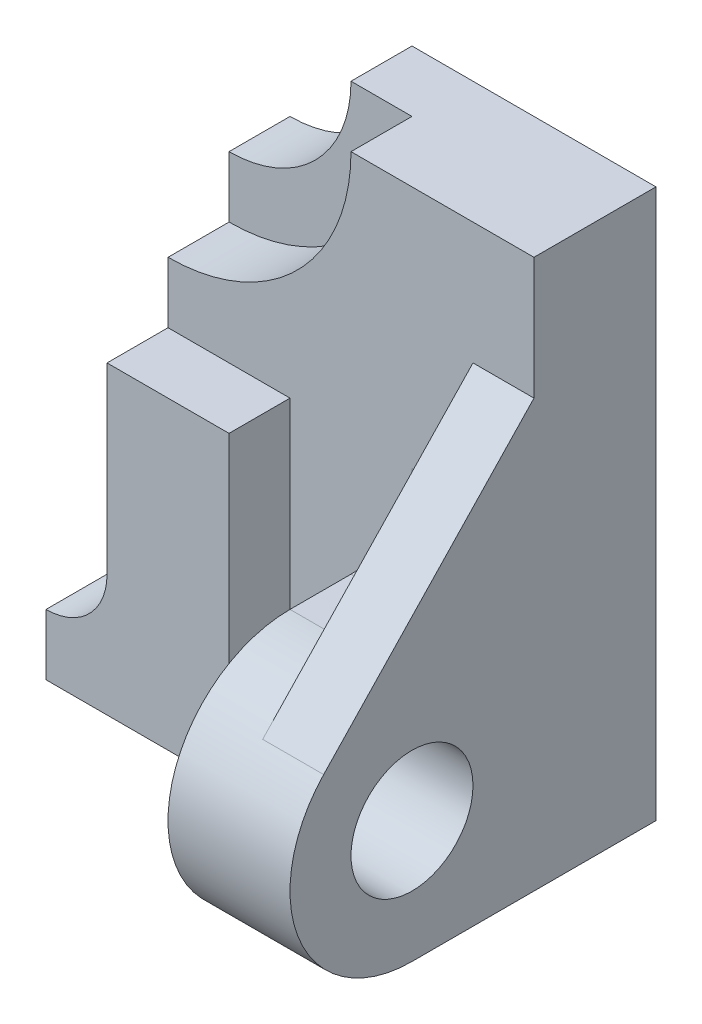
ISO-10303-21;
HEADER;
FILE_DESCRIPTION(('STEP AP214'),'2;1');
FILE_NAME('part.step','',(''),(''),'','','');
FILE_SCHEMA(('AUTOMOTIVE_DESIGN { 1 0 10303 214 1 1 1 1 }'));
ENDSEC;
DATA;
#1=APPLICATION_CONTEXT('core data for automotive mechanical design processes');
#2=APPLICATION_PROTOCOL_DEFINITION('international standard','automotive_design',2000,#1);
#3=PRODUCT_CONTEXT('',#1,'mechanical');
#4=PRODUCT('Part','Part','',(#3));
#5=PRODUCT_RELATED_PRODUCT_CATEGORY('part','',(#4));
#6=PRODUCT_DEFINITION_FORMATION('','',#4);
#7=PRODUCT_DEFINITION_CONTEXT('part definition',#1,'design');
#8=PRODUCT_DEFINITION('design','',#6,#7);
#9=PRODUCT_DEFINITION_SHAPE('','',#8);
#10=(LENGTH_UNIT() NAMED_UNIT(*) SI_UNIT(.MILLI.,.METRE.));
#11=(NAMED_UNIT(*) PLANE_ANGLE_UNIT() SI_UNIT($,.RADIAN.));
#12=(NAMED_UNIT(*) SI_UNIT($,.STERADIAN.) SOLID_ANGLE_UNIT());
#13=UNCERTAINTY_MEASURE_WITH_UNIT(LENGTH_MEASURE(1.E-05),#10,'distance_accuracy_value','');
#14=(GEOMETRIC_REPRESENTATION_CONTEXT(3) GLOBAL_UNCERTAINTY_ASSIGNED_CONTEXT((#13)) GLOBAL_UNIT_ASSIGNED_CONTEXT((#10,
#11,#12)) REPRESENTATION_CONTEXT('',''));
#15=CARTESIAN_POINT('',(0.,0.,0.));
#16=DIRECTION('',(0.,0.,1.));
#17=DIRECTION('',(1.,0.,0.));
#18=AXIS2_PLACEMENT_3D('',#15,#16,#17);
#19=CARTESIAN_POINT('',(1.,-2.5,4.));
#20=DIRECTION('',(1.,0.,0.));
#21=DIRECTION('',(0.,0.,-1.));
#22=AXIS2_PLACEMENT_3D('',#19,#20,#21);
#23=CYLINDRICAL_SURFACE('',#22,2.);
#24=DIRECTION('',(1.,0.,0.));
#25=VECTOR('',#24,1.);
#26=CARTESIAN_POINT('',(2.,-1.12068965517241,5.44827586206897));
#27=LINE('',#26,#25);
#28=CARTESIAN_POINT('',(2.,-1.12068965517241,5.44827586206897));
#29=VERTEX_POINT('',#28);
#30=CARTESIAN_POINT('',(3.,-1.12068965517241,5.44827586206897));
#31=VERTEX_POINT('',#30);
#32=EDGE_CURVE('E200',#29,#31,#27,.T.);
#33=ORIENTED_EDGE('',*,*,#32,.F.);
#34=CARTESIAN_POINT('',(2.,-2.5,4.));
#35=DIRECTION('',(-1.,0.,0.));
#36=DIRECTION('',(0.,0.,1.));
#37=AXIS2_PLACEMENT_3D('',#34,#35,#36);
#38=CIRCLE('',#37,2.);
#39=CARTESIAN_POINT('',(2.,-0.499999999999998,4.));
#40=VERTEX_POINT('',#39);
#41=EDGE_CURVE('E336',#29,#40,#38,.T.);
#42=ORIENTED_EDGE('',*,*,#41,.T.);
#43=DIRECTION('',(1.,0.,0.));
#44=VECTOR('',#43,1.);
#45=CARTESIAN_POINT('',(1.,-0.499999999999998,4.));
#46=LINE('',#45,#44);
#47=CARTESIAN_POINT('',(1.,-0.499999999999998,4.));
#48=VERTEX_POINT('',#47);
#49=EDGE_CURVE('E181',#48,#40,#46,.T.);
#50=ORIENTED_EDGE('',*,*,#49,.F.);
#51=CARTESIAN_POINT('',(1.,-2.5,4.));
#52=DIRECTION('',(1.,0.,0.));
#53=DIRECTION('',(0.,0.,-1.));
#54=AXIS2_PLACEMENT_3D('',#51,#52,#53);
#55=CIRCLE('',#54,2.);
#56=CARTESIAN_POINT('',(1.,-4.5,4.));
#57=VERTEX_POINT('',#56);
#58=EDGE_CURVE('E169',#57,#48,#55,.F.);
#59=ORIENTED_EDGE('',*,*,#58,.F.);
#60=DIRECTION('',(1.,0.,0.));
#61=VECTOR('',#60,1.);
#62=CARTESIAN_POINT('',(1.,-4.5,4.));
#63=LINE('',#62,#61);
#64=CARTESIAN_POINT('',(3.,-4.5,4.));
#65=VERTEX_POINT('',#64);
#66=EDGE_CURVE('E204',#57,#65,#63,.T.);
#67=ORIENTED_EDGE('',*,*,#66,.T.);
#68=CARTESIAN_POINT('',(3.,-2.5,4.));
#69=DIRECTION('',(1.,0.,0.));
#70=DIRECTION('',(0.,0.,-1.));
#71=AXIS2_PLACEMENT_3D('',#68,#69,#70);
#72=CIRCLE('',#71,2.);
#73=EDGE_CURVE('E189',#65,#31,#72,.F.);
#74=ORIENTED_EDGE('',*,*,#73,.T.);
#75=EDGE_LOOP('',(#33,#42,#50,#59,#67,#74));
#76=FACE_BOUND('',#75,.T.);
#77=ADVANCED_FACE('F35',(#76),#23,.T.);
#78=CARTESIAN_POINT('',(0.,0.,2.));
#79=DIRECTION('',(0.,0.,1.));
#80=DIRECTION('',(1.,0.,0.));
#81=AXIS2_PLACEMENT_3D('',#78,#79,#80);
#82=PLANE('',#81);
#83=DIRECTION('',(1.,0.,0.));
#84=VECTOR('',#83,1.);
#85=CARTESIAN_POINT('',(2.,2.5,2.));
#86=LINE('',#85,#84);
#87=CARTESIAN_POINT('',(2.,2.5,2.));
#88=VERTEX_POINT('',#87);
#89=CARTESIAN_POINT('',(3.,2.5,2.));
#90=VERTEX_POINT('',#89);
#91=EDGE_CURVE('E56',#88,#90,#86,.T.);
#92=ORIENTED_EDGE('',*,*,#91,.T.);
#93=DIRECTION('',(0.,1.,0.));
#94=VECTOR('',#93,1.);
#95=CARTESIAN_POINT('',(3.,-4.5,2.));
#96=LINE('',#95,#94);
#97=CARTESIAN_POINT('',(3.,4.5,2.));
#98=VERTEX_POINT('',#97);
#99=EDGE_CURVE('E273',#90,#98,#96,.T.);
#100=ORIENTED_EDGE('',*,*,#99,.T.);
#101=DIRECTION('',(-1.,0.,0.));
#102=VECTOR('',#101,1.);
#103=CARTESIAN_POINT('',(3.,4.5,2.));
#104=LINE('',#103,#102);
#105=CARTESIAN_POINT('',(0.,4.5,2.));
#106=VERTEX_POINT('',#105);
#107=EDGE_CURVE('E281',#98,#106,#104,.T.);
#108=ORIENTED_EDGE('',*,*,#107,.T.);
#109=CARTESIAN_POINT('',(-3.,4.5,2.));
#110=DIRECTION('',(0.,0.,1.));
#111=DIRECTION('',(-1.,0.,0.));
#112=AXIS2_PLACEMENT_3D('',#109,#110,#111);
#113=CIRCLE('',#112,3.);
#114=CARTESIAN_POINT('',(-3.,1.5,2.));
#115=VERTEX_POINT('',#114);
#116=EDGE_CURVE('E260',#115,#106,#113,.T.);
#117=ORIENTED_EDGE('',*,*,#116,.F.);
#118=DIRECTION('',(0.,-1.,0.));
#119=VECTOR('',#118,1.);
#120=CARTESIAN_POINT('',(-3.,-4.5,2.));
#121=LINE('',#120,#119);
#122=CARTESIAN_POINT('',(-3.,0.500000000000001,2.));
#123=VERTEX_POINT('',#122);
#124=EDGE_CURVE('E274',#115,#123,#121,.T.);
#125=ORIENTED_EDGE('',*,*,#124,.T.);
#126=DIRECTION('',(-1.,0.,0.));
#127=VECTOR('',#126,1.);
#128=CARTESIAN_POINT('',(-3.,0.500000000000001,2.));
#129=LINE('',#128,#127);
#130=CARTESIAN_POINT('',(-0.999999999999999,0.500000000000001,2.));
#131=VERTEX_POINT('',#130);
#132=EDGE_CURVE('E232',#131,#123,#129,.T.);
#133=ORIENTED_EDGE('',*,*,#132,.F.);
#134=DIRECTION('',(0.,1.,0.));
#135=VECTOR('',#134,1.);
#136=CARTESIAN_POINT('',(-0.999999999999999,0.500000000000001,2.));
#137=LINE('',#136,#135);
#138=CARTESIAN_POINT('',(-0.999999999999999,-4.5,2.));
#139=VERTEX_POINT('',#138);
#140=EDGE_CURVE('E223',#139,#131,#137,.T.);
#141=ORIENTED_EDGE('',*,*,#140,.F.);
#142=DIRECTION('',(1.,0.,0.));
#143=VECTOR('',#142,1.);
#144=CARTESIAN_POINT('',(3.,-4.5,2.));
#145=LINE('',#144,#143);
#146=CARTESIAN_POINT('',(1.,-4.5,2.));
#147=VERTEX_POINT('',#146);
#148=EDGE_CURVE('E270',#139,#147,#145,.T.);
#149=ORIENTED_EDGE('',*,*,#148,.T.);
#150=DIRECTION('',(0.,-1.,0.));
#151=VECTOR('',#150,1.);
#152=CARTESIAN_POINT('',(1.,0.,2.));
#153=LINE('',#152,#151);
#154=CARTESIAN_POINT('',(1.,0.500000000000001,2.));
#155=VERTEX_POINT('',#154);
#156=EDGE_CURVE('E182',#155,#147,#153,.T.);
#157=ORIENTED_EDGE('',*,*,#156,.F.);
#158=DIRECTION('',(1.,0.,0.));
#159=VECTOR('',#158,1.);
#160=CARTESIAN_POINT('',(1.,0.500000000000001,2.));
#161=LINE('',#160,#159);
#162=CARTESIAN_POINT('',(2.,0.500000000000001,2.));
#163=VERTEX_POINT('',#162);
#164=EDGE_CURVE('E185',#155,#163,#161,.T.);
#165=ORIENTED_EDGE('',*,*,#164,.T.);
#166=DIRECTION('',(0.,1.,0.));
#167=VECTOR('',#166,1.);
#168=CARTESIAN_POINT('',(2.,2.5,2.));
#169=LINE('',#168,#167);
#170=EDGE_CURVE('E52',#163,#88,#169,.T.);
#171=ORIENTED_EDGE('',*,*,#170,.T.);
#172=EDGE_LOOP('',(#92,#100,#108,#117,#125,#133,#141,#149,#157,#165,#171));
#173=FACE_BOUND('',#172,.T.);
#174=ADVANCED_FACE('F346',(#173),#82,.T.);
#175=CARTESIAN_POINT('',(-3.,-4.5,2.));
#176=DIRECTION('',(1.,0.,0.));
#177=DIRECTION('',(0.,0.,-1.));
#178=AXIS2_PLACEMENT_3D('',#175,#176,#177);
#179=PLANE('',#178);
#180=DIRECTION('',(0.,0.,1.));
#181=VECTOR('',#180,1.);
#182=CARTESIAN_POINT('',(-3.,-2.5,0.));
#183=LINE('',#182,#181);
#184=CARTESIAN_POINT('',(-3.,-2.5,0.));
#185=VERTEX_POINT('',#184);
#186=CARTESIAN_POINT('',(-3.,-2.5,3.));
#187=VERTEX_POINT('',#186);
#188=EDGE_CURVE('E215',#185,#187,#183,.T.);
#189=ORIENTED_EDGE('',*,*,#188,.T.);
#190=DIRECTION('',(0.,-1.,0.));
#191=VECTOR('',#190,1.);
#192=CARTESIAN_POINT('',(-3.,-4.5,3.));
#193=LINE('',#192,#191);
#194=CARTESIAN_POINT('',(-3.,0.500000000000001,3.));
#195=VERTEX_POINT('',#194);
#196=EDGE_CURVE('E236',#195,#187,#193,.T.);
#197=ORIENTED_EDGE('',*,*,#196,.F.);
#198=DIRECTION('',(0.,0.,-1.));
#199=VECTOR('',#198,1.);
#200=CARTESIAN_POINT('',(-3.,0.500000000000001,3.));
#201=LINE('',#200,#199);
#202=EDGE_CURVE('E239',#195,#123,#201,.T.);
#203=ORIENTED_EDGE('',*,*,#202,.T.);
#204=ORIENTED_EDGE('',*,*,#124,.F.);
#205=DIRECTION('',(0.,0.,1.));
#206=VECTOR('',#205,1.);
#207=CARTESIAN_POINT('',(-3.,1.5,1.));
#208=LINE('',#207,#206);
#209=CARTESIAN_POINT('',(-3.,1.5,1.));
#210=VERTEX_POINT('',#209);
#211=EDGE_CURVE('E367',#210,#115,#208,.T.);
#212=ORIENTED_EDGE('',*,*,#211,.F.);
#213=DIRECTION('',(0.,-1.,0.));
#214=VECTOR('',#213,1.);
#215=CARTESIAN_POINT('',(-3.,4.5,1.));
#216=LINE('',#215,#214);
#217=CARTESIAN_POINT('',(-3.,2.5,1.));
#218=VERTEX_POINT('',#217);
#219=EDGE_CURVE('E264',#218,#210,#216,.T.);
#220=ORIENTED_EDGE('',*,*,#219,.F.);
#221=DIRECTION('',(0.,0.,1.));
#222=VECTOR('',#221,1.);
#223=CARTESIAN_POINT('',(-3.,2.5,0.));
#224=LINE('',#223,#222);
#225=CARTESIAN_POINT('',(-3.,2.5,0.));
#226=VERTEX_POINT('',#225);
#227=EDGE_CURVE('E360',#226,#218,#224,.T.);
#228=ORIENTED_EDGE('',*,*,#227,.F.);
#229=DIRECTION('',(0.,-1.,0.));
#230=VECTOR('',#229,1.);
#231=CARTESIAN_POINT('',(-3.,-4.5,0.));
#232=LINE('',#231,#230);
#233=EDGE_CURVE('E285',#226,#185,#232,.T.);
#234=ORIENTED_EDGE('',*,*,#233,.T.);
#235=EDGE_LOOP('',(#189,#197,#203,#204,#212,#220,#228,#234));
#236=FACE_BOUND('',#235,.T.);
#237=ADVANCED_FACE('F37',(#236),#179,.F.);
#238=CARTESIAN_POINT('',(3.,-4.5,2.));
#239=DIRECTION('',(0.,1.,0.));
#240=DIRECTION('',(-1.,0.,0.));
#241=AXIS2_PLACEMENT_3D('',#238,#239,#240);
#242=PLANE('',#241);
#243=DIRECTION('',(1.,0.,0.));
#244=VECTOR('',#243,1.);
#245=CARTESIAN_POINT('',(3.,-4.5,0.));
#246=LINE('',#245,#244);
#247=CARTESIAN_POINT('',(-4.,-4.5,0.));
#248=VERTEX_POINT('',#247);
#249=CARTESIAN_POINT('',(3.,-4.5,0.));
#250=VERTEX_POINT('',#249);
#251=EDGE_CURVE('E288',#248,#250,#246,.T.);
#252=ORIENTED_EDGE('',*,*,#251,.T.);
#253=DIRECTION('',(0.,0.,-1.));
#254=VECTOR('',#253,1.);
#255=CARTESIAN_POINT('',(3.,-4.5,2.));
#256=LINE('',#255,#254);
#257=EDGE_CURVE('E44',#65,#250,#256,.T.);
#258=ORIENTED_EDGE('',*,*,#257,.F.);
#259=ORIENTED_EDGE('',*,*,#66,.F.);
#260=DIRECTION('',(0.,0.,1.));
#261=VECTOR('',#260,1.);
#262=CARTESIAN_POINT('',(1.,-4.5,0.));
#263=LINE('',#262,#261);
#264=EDGE_CURVE('E194',#147,#57,#263,.T.);
#265=ORIENTED_EDGE('',*,*,#264,.F.);
#266=ORIENTED_EDGE('',*,*,#148,.F.);
#267=DIRECTION('',(0.,0.,-1.));
#268=VECTOR('',#267,1.);
#269=CARTESIAN_POINT('',(-0.999999999999998,-4.5,3.));
#270=LINE('',#269,#268);
#271=CARTESIAN_POINT('',(-0.999999999999998,-4.5,3.));
#272=VERTEX_POINT('',#271);
#273=EDGE_CURVE('E255',#272,#139,#270,.T.);
#274=ORIENTED_EDGE('',*,*,#273,.F.);
#275=DIRECTION('',(1.,0.,0.));
#276=VECTOR('',#275,1.);
#277=CARTESIAN_POINT('',(-0.999999999999998,-4.5,3.));
#278=LINE('',#277,#276);
#279=CARTESIAN_POINT('',(-4.,-4.5,3.));
#280=VERTEX_POINT('',#279);
#281=EDGE_CURVE('E228',#280,#272,#278,.T.);
#282=ORIENTED_EDGE('',*,*,#281,.F.);
#283=DIRECTION('',(0.,0.,1.));
#284=VECTOR('',#283,1.);
#285=CARTESIAN_POINT('',(-4.,-4.5,0.));
#286=LINE('',#285,#284);
#287=EDGE_CURVE('E220',#248,#280,#286,.T.);
#288=ORIENTED_EDGE('',*,*,#287,.F.);
#289=EDGE_LOOP('',(#252,#258,#259,#265,#266,#274,#282,#288));
#290=FACE_BOUND('',#289,.T.);
#291=ADVANCED_FACE('F344',(#290),#242,.F.);
#292=CARTESIAN_POINT('',(3.,-4.5,2.));
#293=DIRECTION('',(-1.,0.,0.));
#294=DIRECTION('',(0.,0.,1.));
#295=AXIS2_PLACEMENT_3D('',#292,#293,#294);
#296=PLANE('',#295);
#297=ORIENTED_EDGE('',*,*,#99,.F.);
#298=DIRECTION('',(0.,-0.724137931034483,0.689655172413793));
#299=VECTOR('',#298,1.);
#300=CARTESIAN_POINT('',(3.,2.5,2.));
#301=LINE('',#300,#299);
#302=EDGE_CURVE('E323',#90,#31,#301,.T.);
#303=ORIENTED_EDGE('',*,*,#302,.T.);
#304=ORIENTED_EDGE('',*,*,#73,.F.);
#305=ORIENTED_EDGE('',*,*,#257,.T.);
#306=DIRECTION('',(0.,1.,0.));
#307=VECTOR('',#306,1.);
#308=CARTESIAN_POINT('',(3.,-4.5,0.));
#309=LINE('',#308,#307);
#310=CARTESIAN_POINT('',(3.,4.5,0.));
#311=VERTEX_POINT('',#310);
#312=EDGE_CURVE('E291',#250,#311,#309,.T.);
#313=ORIENTED_EDGE('',*,*,#312,.T.);
#314=DIRECTION('',(0.,0.,-1.));
#315=VECTOR('',#314,1.);
#316=CARTESIAN_POINT('',(3.,4.5,2.));
#317=LINE('',#316,#315);
#318=EDGE_CURVE('E284',#98,#311,#317,.T.);
#319=ORIENTED_EDGE('',*,*,#318,.F.);
#320=EDGE_LOOP('',(#297,#303,#304,#305,#313,#319));
#321=FACE_BOUND('',#320,.T.);
#322=CARTESIAN_POINT('',(3.,-2.5,4.));
#323=DIRECTION('',(1.,0.,0.));
#324=DIRECTION('',(0.,0.,-1.));
#325=AXIS2_PLACEMENT_3D('',#322,#323,#324);
#326=CIRCLE('',#325,1.);
#327=CARTESIAN_POINT('',(3.,-2.5,3.));
#328=VERTEX_POINT('',#327);
#329=EDGE_CURVE('E197',#328,#328,#326,.T.);
#330=ORIENTED_EDGE('',*,*,#329,.F.);
#331=EDGE_LOOP('',(#330));
#332=FACE_BOUND('',#331,.T.);
#333=ADVANCED_FACE('F302',(#321,#332),#296,.F.);
#334=CARTESIAN_POINT('',(3.,4.5,2.));
#335=DIRECTION('',(0.,-1.,0.));
#336=DIRECTION('',(1.,0.,0.));
#337=AXIS2_PLACEMENT_3D('',#334,#335,#336);
#338=PLANE('',#337);
#339=DIRECTION('',(-1.,0.,0.));
#340=VECTOR('',#339,1.);
#341=CARTESIAN_POINT('',(0.,4.5,1.));
#342=LINE('',#341,#340);
#343=CARTESIAN_POINT('',(0.,4.5,1.));
#344=VERTEX_POINT('',#343);
#345=CARTESIAN_POINT('',(-0.999999999999999,4.5,1.));
#346=VERTEX_POINT('',#345);
#347=EDGE_CURVE('E369',#344,#346,#342,.T.);
#348=ORIENTED_EDGE('',*,*,#347,.F.);
#349=DIRECTION('',(0.,0.,1.));
#350=VECTOR('',#349,1.);
#351=CARTESIAN_POINT('',(0.,4.5,1.));
#352=LINE('',#351,#350);
#353=EDGE_CURVE('E364',#344,#106,#352,.T.);
#354=ORIENTED_EDGE('',*,*,#353,.T.);
#355=ORIENTED_EDGE('',*,*,#107,.F.);
#356=ORIENTED_EDGE('',*,*,#318,.T.);
#357=DIRECTION('',(-1.,0.,0.));
#358=VECTOR('',#357,1.);
#359=CARTESIAN_POINT('',(3.,4.5,0.));
#360=LINE('',#359,#358);
#361=CARTESIAN_POINT('',(-0.999999999999999,4.5,0.));
#362=VERTEX_POINT('',#361);
#363=EDGE_CURVE('E293',#311,#362,#360,.T.);
#364=ORIENTED_EDGE('',*,*,#363,.T.);
#365=DIRECTION('',(0.,0.,1.));
#366=VECTOR('',#365,1.);
#367=CARTESIAN_POINT('',(-0.999999999999999,4.5,0.));
#368=LINE('',#367,#366);
#369=EDGE_CURVE('E289',#362,#346,#368,.T.);
#370=ORIENTED_EDGE('',*,*,#369,.T.);
#371=EDGE_LOOP('',(#348,#354,#355,#356,#364,#370));
#372=FACE_BOUND('',#371,.T.);
#373=ADVANCED_FACE('F319',(#372),#338,.F.);
#374=CARTESIAN_POINT('',(0.,0.,0.));
#375=DIRECTION('',(0.,0.,1.));
#376=DIRECTION('',(1.,0.,0.));
#377=AXIS2_PLACEMENT_3D('',#374,#375,#376);
#378=PLANE('',#377);
#379=ORIENTED_EDGE('',*,*,#233,.F.);
#380=CARTESIAN_POINT('',(-3.,4.5,0.));
#381=DIRECTION('',(0.,0.,1.));
#382=DIRECTION('',(-1.,0.,0.));
#383=AXIS2_PLACEMENT_3D('',#380,#381,#382);
#384=CIRCLE('',#383,2.);
#385=EDGE_CURVE('E315',#226,#362,#384,.T.);
#386=ORIENTED_EDGE('',*,*,#385,.T.);
#387=ORIENTED_EDGE('',*,*,#363,.F.);
#388=ORIENTED_EDGE('',*,*,#312,.F.);
#389=ORIENTED_EDGE('',*,*,#251,.F.);
#390=DIRECTION('',(0.,-1.,0.));
#391=VECTOR('',#390,1.);
#392=CARTESIAN_POINT('',(-4.,-4.5,0.));
#393=LINE('',#392,#391);
#394=CARTESIAN_POINT('',(-4.,-3.5,0.));
#395=VERTEX_POINT('',#394);
#396=EDGE_CURVE('E211',#395,#248,#393,.T.);
#397=ORIENTED_EDGE('',*,*,#396,.F.);
#398=CARTESIAN_POINT('',(-4.,-2.5,0.));
#399=DIRECTION('',(0.,0.,-1.));
#400=DIRECTION('',(1.,0.,0.));
#401=AXIS2_PLACEMENT_3D('',#398,#399,#400);
#402=CIRCLE('',#401,1.);
#403=EDGE_CURVE('E208',#185,#395,#402,.T.);
#404=ORIENTED_EDGE('',*,*,#403,.F.);
#405=EDGE_LOOP('',(#379,#386,#387,#388,#389,#397,#404));
#406=FACE_BOUND('',#405,.T.);
#407=ADVANCED_FACE('F311',(#406),#378,.F.);
#408=CARTESIAN_POINT('',(-3.,4.5,0.));
#409=DIRECTION('',(0.,0.,1.));
#410=DIRECTION('',(1.,0.,0.));
#411=AXIS2_PLACEMENT_3D('',#408,#409,#410);
#412=CYLINDRICAL_SURFACE('',#411,2.);
#413=ORIENTED_EDGE('',*,*,#227,.T.);
#414=CARTESIAN_POINT('',(-3.,4.5,1.));
#415=DIRECTION('',(0.,0.,-1.));
#416=DIRECTION('',(-1.,0.,0.));
#417=AXIS2_PLACEMENT_3D('',#414,#415,#416);
#418=CIRCLE('',#417,2.);
#419=EDGE_CURVE('E11',#218,#346,#418,.F.);
#420=ORIENTED_EDGE('',*,*,#419,.T.);
#421=ORIENTED_EDGE('',*,*,#369,.F.);
#422=ORIENTED_EDGE('',*,*,#385,.F.);
#423=EDGE_LOOP('',(#413,#420,#421,#422));
#424=FACE_BOUND('',#423,.T.);
#425=ADVANCED_FACE('F380',(#424),#412,.F.);
#426=CARTESIAN_POINT('',(-3.,4.5,1.));
#427=DIRECTION('',(0.,0.,-1.));
#428=DIRECTION('',(-1.,0.,0.));
#429=AXIS2_PLACEMENT_3D('',#426,#427,#428);
#430=PLANE('',#429);
#431=ORIENTED_EDGE('',*,*,#219,.T.);
#432=CARTESIAN_POINT('',(-3.,4.5,1.));
#433=DIRECTION('',(0.,0.,1.));
#434=DIRECTION('',(-1.,0.,0.));
#435=AXIS2_PLACEMENT_3D('',#432,#433,#434);
#436=CIRCLE('',#435,3.);
#437=EDGE_CURVE('E372',#210,#344,#436,.T.);
#438=ORIENTED_EDGE('',*,*,#437,.T.);
#439=ORIENTED_EDGE('',*,*,#347,.T.);
#440=ORIENTED_EDGE('',*,*,#419,.F.);
#441=EDGE_LOOP('',(#431,#438,#439,#440));
#442=FACE_BOUND('',#441,.T.);
#443=ADVANCED_FACE('F376',(#442),#430,.F.);
#444=CARTESIAN_POINT('',(-3.,4.5,1.));
#445=DIRECTION('',(0.,0.,1.));
#446=DIRECTION('',(1.,0.,0.));
#447=AXIS2_PLACEMENT_3D('',#444,#445,#446);
#448=CYLINDRICAL_SURFACE('',#447,3.);
#449=ORIENTED_EDGE('',*,*,#116,.T.);
#450=ORIENTED_EDGE('',*,*,#353,.F.);
#451=ORIENTED_EDGE('',*,*,#437,.F.);
#452=ORIENTED_EDGE('',*,*,#211,.T.);
#453=EDGE_LOOP('',(#449,#450,#451,#452));
#454=FACE_BOUND('',#453,.T.);
#455=ADVANCED_FACE('F378',(#454),#448,.F.);
#456=CARTESIAN_POINT('',(-0.999999999999999,0.500000000000001,3.));
#457=DIRECTION('',(-1.,0.,0.));
#458=DIRECTION('',(0.,-1.,0.));
#459=AXIS2_PLACEMENT_3D('',#456,#457,#458);
#460=PLANE('',#459);
#461=ORIENTED_EDGE('',*,*,#140,.T.);
#462=DIRECTION('',(0.,0.,-1.));
#463=VECTOR('',#462,1.);
#464=CARTESIAN_POINT('',(-0.999999999999999,0.500000000000001,3.));
#465=LINE('',#464,#463);
#466=CARTESIAN_POINT('',(-0.999999999999999,0.500000000000001,3.));
#467=VERTEX_POINT('',#466);
#468=EDGE_CURVE('E242',#467,#131,#465,.T.);
#469=ORIENTED_EDGE('',*,*,#468,.F.);
#470=DIRECTION('',(0.,1.,0.));
#471=VECTOR('',#470,1.);
#472=CARTESIAN_POINT('',(-0.999999999999999,0.500000000000001,3.));
#473=LINE('',#472,#471);
#474=EDGE_CURVE('E231',#272,#467,#473,.T.);
#475=ORIENTED_EDGE('',*,*,#474,.F.);
#476=ORIENTED_EDGE('',*,*,#273,.T.);
#477=EDGE_LOOP('',(#461,#469,#475,#476));
#478=FACE_BOUND('',#477,.T.);
#479=ADVANCED_FACE('F347',(#478),#460,.F.);
#480=CARTESIAN_POINT('',(-3.,0.500000000000001,3.));
#481=DIRECTION('',(0.,-1.,0.));
#482=DIRECTION('',(0.,0.,-1.));
#483=AXIS2_PLACEMENT_3D('',#480,#481,#482);
#484=PLANE('',#483);
#485=ORIENTED_EDGE('',*,*,#132,.T.);
#486=ORIENTED_EDGE('',*,*,#202,.F.);
#487=DIRECTION('',(-1.,0.,0.));
#488=VECTOR('',#487,1.);
#489=CARTESIAN_POINT('',(-3.,0.500000000000001,3.));
#490=LINE('',#489,#488);
#491=EDGE_CURVE('E234',#467,#195,#490,.T.);
#492=ORIENTED_EDGE('',*,*,#491,.F.);
#493=ORIENTED_EDGE('',*,*,#468,.T.);
#494=EDGE_LOOP('',(#485,#486,#492,#493));
#495=FACE_BOUND('',#494,.T.);
#496=ADVANCED_FACE('F348',(#495),#484,.F.);
#497=CARTESIAN_POINT('',(0.,0.,3.));
#498=DIRECTION('',(0.,0.,-1.));
#499=DIRECTION('',(-1.,0.,0.));
#500=AXIS2_PLACEMENT_3D('',#497,#498,#499);
#501=PLANE('',#500);
#502=ORIENTED_EDGE('',*,*,#281,.T.);
#503=ORIENTED_EDGE('',*,*,#474,.T.);
#504=ORIENTED_EDGE('',*,*,#491,.T.);
#505=ORIENTED_EDGE('',*,*,#196,.T.);
#506=CARTESIAN_POINT('',(-4.,-2.5,3.));
#507=DIRECTION('',(0.,0.,-1.));
#508=DIRECTION('',(1.,0.,0.));
#509=AXIS2_PLACEMENT_3D('',#506,#507,#508);
#510=CIRCLE('',#509,1.);
#511=CARTESIAN_POINT('',(-4.,-3.5,3.));
#512=VERTEX_POINT('',#511);
#513=EDGE_CURVE('E203',#187,#512,#510,.T.);
#514=ORIENTED_EDGE('',*,*,#513,.T.);
#515=DIRECTION('',(0.,-1.,0.));
#516=VECTOR('',#515,1.);
#517=CARTESIAN_POINT('',(-4.,-4.5,3.));
#518=LINE('',#517,#516);
#519=EDGE_CURVE('E212',#512,#280,#518,.T.);
#520=ORIENTED_EDGE('',*,*,#519,.T.);
#521=EDGE_LOOP('',(#502,#503,#504,#505,#514,#520));
#522=FACE_BOUND('',#521,.T.);
#523=ADVANCED_FACE('F350',(#522),#501,.F.);
#524=CARTESIAN_POINT('',(-4.,-4.5,0.));
#525=DIRECTION('',(-1.,0.,0.));
#526=DIRECTION('',(0.,0.,1.));
#527=AXIS2_PLACEMENT_3D('',#524,#525,#526);
#528=PLANE('',#527);
#529=ORIENTED_EDGE('',*,*,#519,.F.);
#530=DIRECTION('',(0.,0.,1.));
#531=VECTOR('',#530,1.);
#532=CARTESIAN_POINT('',(-4.,-3.5,0.));
#533=LINE('',#532,#531);
#534=EDGE_CURVE('E224',#395,#512,#533,.T.);
#535=ORIENTED_EDGE('',*,*,#534,.F.);
#536=ORIENTED_EDGE('',*,*,#396,.T.);
#537=ORIENTED_EDGE('',*,*,#287,.T.);
#538=EDGE_LOOP('',(#529,#535,#536,#537));
#539=FACE_BOUND('',#538,.T.);
#540=ADVANCED_FACE('F353',(#539),#528,.T.);
#541=CARTESIAN_POINT('',(-4.,-2.5,0.));
#542=DIRECTION('',(0.,0.,1.));
#543=DIRECTION('',(1.,0.,0.));
#544=AXIS2_PLACEMENT_3D('',#541,#542,#543);
#545=CYLINDRICAL_SURFACE('',#544,1.);
#546=ORIENTED_EDGE('',*,*,#513,.F.);
#547=ORIENTED_EDGE('',*,*,#188,.F.);
#548=ORIENTED_EDGE('',*,*,#403,.T.);
#549=ORIENTED_EDGE('',*,*,#534,.T.);
#550=EDGE_LOOP('',(#546,#547,#548,#549));
#551=FACE_BOUND('',#550,.T.);
#552=ADVANCED_FACE('F356',(#551),#545,.F.);
#553=CARTESIAN_POINT('',(1.,0.500000000000001,3.));
#554=DIRECTION('',(1.,0.,0.));
#555=DIRECTION('',(0.,0.,-1.));
#556=AXIS2_PLACEMENT_3D('',#553,#554,#555);
#557=CYLINDRICAL_SURFACE('',#556,0.999999999999999);
#558=DIRECTION('',(1.,0.,0.));
#559=VECTOR('',#558,1.);
#560=CARTESIAN_POINT('',(1.,-0.499999999999998,3.));
#561=LINE('',#560,#559);
#562=CARTESIAN_POINT('',(1.,-0.499999999999998,3.));
#563=VERTEX_POINT('',#562);
#564=CARTESIAN_POINT('',(2.,-0.499999999999998,3.));
#565=VERTEX_POINT('',#564);
#566=EDGE_CURVE('E175',#563,#565,#561,.T.);
#567=ORIENTED_EDGE('',*,*,#566,.T.);
#568=CARTESIAN_POINT('',(2.,0.500000000000002,3.));
#569=DIRECTION('',(1.,0.,0.));
#570=DIRECTION('',(0.,0.,1.));
#571=AXIS2_PLACEMENT_3D('',#568,#569,#570);
#572=CIRCLE('',#571,1.);
#573=EDGE_CURVE('E334',#565,#163,#572,.T.);
#574=ORIENTED_EDGE('',*,*,#573,.T.);
#575=ORIENTED_EDGE('',*,*,#164,.F.);
#576=CARTESIAN_POINT('',(1.,0.500000000000001,3.));
#577=DIRECTION('',(1.,0.,0.));
#578=DIRECTION('',(0.,0.,-1.));
#579=AXIS2_PLACEMENT_3D('',#576,#577,#578);
#580=CIRCLE('',#579,0.999999999999999);
#581=EDGE_CURVE('E166',#563,#155,#580,.T.);
#582=ORIENTED_EDGE('',*,*,#581,.F.);
#583=EDGE_LOOP('',(#567,#574,#575,#582));
#584=FACE_BOUND('',#583,.T.);
#585=ADVANCED_FACE('F184',(#584),#557,.F.);
#586=CARTESIAN_POINT('',(1.,-2.5,4.));
#587=DIRECTION('',(1.,0.,0.));
#588=DIRECTION('',(0.,0.,-1.));
#589=AXIS2_PLACEMENT_3D('',#586,#587,#588);
#590=CYLINDRICAL_SURFACE('',#589,1.);
#591=CARTESIAN_POINT('',(1.,-2.5,4.));
#592=DIRECTION('',(1.,0.,0.));
#593=DIRECTION('',(0.,0.,-1.));
#594=AXIS2_PLACEMENT_3D('',#591,#592,#593);
#595=CIRCLE('',#594,1.);
#596=CARTESIAN_POINT('',(1.,-2.5,3.));
#597=VERTEX_POINT('',#596);
#598=EDGE_CURVE('E186',#597,#597,#595,.T.);
#599=ORIENTED_EDGE('',*,*,#598,.F.);
#600=EDGE_LOOP('',(#599));
#601=FACE_BOUND('',#600,.T.);
#602=ORIENTED_EDGE('',*,*,#329,.T.);
#603=EDGE_LOOP('',(#602));
#604=FACE_BOUND('',#603,.T.);
#605=ADVANCED_FACE('F401',(#601,#604),#590,.F.);
#606=CARTESIAN_POINT('',(1.,-0.499999999999998,0.));
#607=DIRECTION('',(0.,-1.,0.));
#608=DIRECTION('',(0.,0.,-1.));
#609=AXIS2_PLACEMENT_3D('',#606,#607,#608);
#610=PLANE('',#609);
#611=ORIENTED_EDGE('',*,*,#49,.T.);
#612=DIRECTION('',(0.,0.,-1.));
#613=VECTOR('',#612,1.);
#614=CARTESIAN_POINT('',(2.,-0.499999999999998,3.));
#615=LINE('',#614,#613);
#616=EDGE_CURVE('E178',#40,#565,#615,.T.);
#617=ORIENTED_EDGE('',*,*,#616,.T.);
#618=ORIENTED_EDGE('',*,*,#566,.F.);
#619=DIRECTION('',(0.,0.,-1.));
#620=VECTOR('',#619,1.);
#621=CARTESIAN_POINT('',(1.,-0.499999999999998,0.));
#622=LINE('',#621,#620);
#623=EDGE_CURVE('E161',#48,#563,#622,.T.);
#624=ORIENTED_EDGE('',*,*,#623,.F.);
#625=EDGE_LOOP('',(#611,#617,#618,#624));
#626=FACE_BOUND('',#625,.T.);
#627=ADVANCED_FACE('F176',(#626),#610,.F.);
#628=CARTESIAN_POINT('',(1.,0.,0.));
#629=DIRECTION('',(1.,0.,0.));
#630=DIRECTION('',(0.,0.,-1.));
#631=AXIS2_PLACEMENT_3D('',#628,#629,#630);
#632=PLANE('',#631);
#633=ORIENTED_EDGE('',*,*,#598,.T.);
#634=EDGE_LOOP('',(#633));
#635=FACE_BOUND('',#634,.T.);
#636=ORIENTED_EDGE('',*,*,#581,.T.);
#637=ORIENTED_EDGE('',*,*,#156,.T.);
#638=ORIENTED_EDGE('',*,*,#264,.T.);
#639=ORIENTED_EDGE('',*,*,#58,.T.);
#640=ORIENTED_EDGE('',*,*,#623,.T.);
#641=EDGE_LOOP('',(#636,#637,#638,#639,#640));
#642=FACE_BOUND('',#641,.T.);
#643=ADVANCED_FACE('F163',(#635,#642),#632,.F.);
#644=CARTESIAN_POINT('',(2.,2.5,2.));
#645=DIRECTION('',(0.,0.689655172413793,0.724137931034483));
#646=DIRECTION('',(0.,-0.724137931034483,0.689655172413793));
#647=AXIS2_PLACEMENT_3D('',#644,#645,#646);
#648=PLANE('',#647);
#649=ORIENTED_EDGE('',*,*,#302,.F.);
#650=ORIENTED_EDGE('',*,*,#91,.F.);
#651=DIRECTION('',(0.,-0.724137931034483,0.689655172413793));
#652=VECTOR('',#651,1.);
#653=CARTESIAN_POINT('',(2.,2.5,2.));
#654=LINE('',#653,#652);
#655=EDGE_CURVE('E330',#88,#29,#654,.T.);
#656=ORIENTED_EDGE('',*,*,#655,.T.);
#657=ORIENTED_EDGE('',*,*,#32,.T.);
#658=EDGE_LOOP('',(#649,#650,#656,#657));
#659=FACE_BOUND('',#658,.T.);
#660=ADVANCED_FACE('F326',(#659),#648,.T.);
#661=CARTESIAN_POINT('',(2.,0.500000000000002,3.));
#662=DIRECTION('',(-1.,0.,0.));
#663=DIRECTION('',(0.,0.,1.));
#664=AXIS2_PLACEMENT_3D('',#661,#662,#663);
#665=PLANE('',#664);
#666=ORIENTED_EDGE('',*,*,#170,.F.);
#667=ORIENTED_EDGE('',*,*,#573,.F.);
#668=ORIENTED_EDGE('',*,*,#616,.F.);
#669=ORIENTED_EDGE('',*,*,#41,.F.);
#670=ORIENTED_EDGE('',*,*,#655,.F.);
#671=EDGE_LOOP('',(#666,#667,#668,#669,#670));
#672=FACE_BOUND('',#671,.T.);
#673=ADVANCED_FACE('F341',(#672),#665,.T.);
#674=CLOSED_SHELL('',(#77,#174,#237,#291,#333,#373,#407,#425,#443,#455,#479,#496,#523,#540,#552,
#585,#605,#627,#643,#660,#673));
#675=MANIFOLD_SOLID_BREP('B2',#674);
#676=ADVANCED_BREP_SHAPE_REPRESENTATION('',(#18,#675),#14);
#677=SHAPE_DEFINITION_REPRESENTATION(#9,#676);
ENDSEC;
END-ISO-10303-21;
